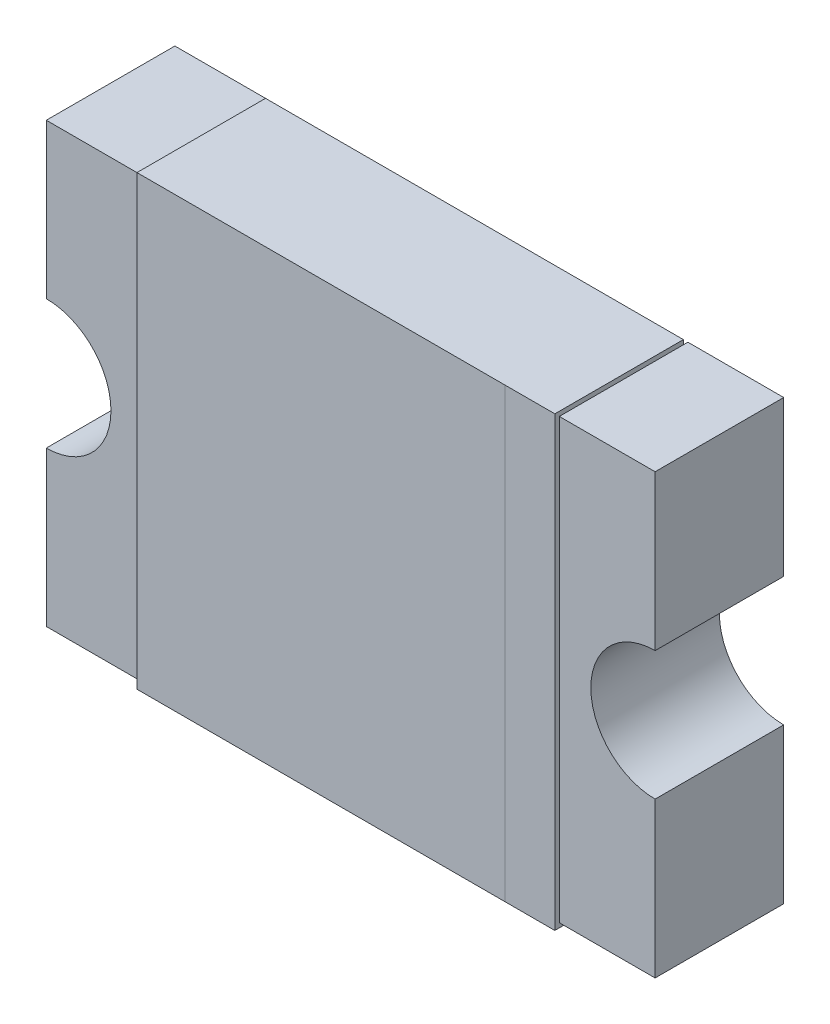
ISO-10303-21;
HEADER;
FILE_DESCRIPTION(('STEP AP214'),'2;1');
FILE_NAME('part.step','',(''),(''),'','','');
FILE_SCHEMA(('AUTOMOTIVE_DESIGN { 1 0 10303 214 1 1 1 1 }'));
ENDSEC;
DATA;
#1=APPLICATION_CONTEXT('core data for automotive mechanical design processes');
#2=APPLICATION_PROTOCOL_DEFINITION('international standard','automotive_design',2000,#1);
#3=PRODUCT_CONTEXT('',#1,'mechanical');
#4=PRODUCT('Part','Part','',(#3));
#5=PRODUCT_RELATED_PRODUCT_CATEGORY('part','',(#4));
#6=PRODUCT_DEFINITION_FORMATION('','',#4);
#7=PRODUCT_DEFINITION_CONTEXT('part definition',#1,'design');
#8=PRODUCT_DEFINITION('design','',#6,#7);
#9=PRODUCT_DEFINITION_SHAPE('','',#8);
#10=(LENGTH_UNIT() NAMED_UNIT(*) SI_UNIT(.MILLI.,.METRE.));
#11=(NAMED_UNIT(*) PLANE_ANGLE_UNIT() SI_UNIT($,.RADIAN.));
#12=(NAMED_UNIT(*) SI_UNIT($,.STERADIAN.) SOLID_ANGLE_UNIT());
#13=UNCERTAINTY_MEASURE_WITH_UNIT(LENGTH_MEASURE(1.E-05),#10,'distance_accuracy_value','');
#14=(GEOMETRIC_REPRESENTATION_CONTEXT(3) GLOBAL_UNCERTAINTY_ASSIGNED_CONTEXT((#13)) GLOBAL_UNIT_ASSIGNED_CONTEXT((#10,
#11,#12)) REPRESENTATION_CONTEXT('',''));
#15=CARTESIAN_POINT('',(0.,0.,0.));
#16=DIRECTION('',(0.,0.,1.));
#17=DIRECTION('',(1.,0.,0.));
#18=AXIS2_PLACEMENT_3D('',#15,#16,#17);
#19=CARTESIAN_POINT('',(-2.365,-1.705,0.));
#20=DIRECTION('',(0.,0.,1.));
#21=DIRECTION('',(1.,0.,0.));
#22=AXIS2_PLACEMENT_3D('',#19,#20,#21);
#23=PLANE('',#22);
#24=DIRECTION('',(-1.,0.,0.));
#25=VECTOR('',#24,1.);
#26=CARTESIAN_POINT('',(-2.365,1.705,0.));
#27=LINE('',#26,#25);
#28=CARTESIAN_POINT('',(-1.625,1.705,0.));
#29=VERTEX_POINT('',#28);
#30=CARTESIAN_POINT('',(-2.365,1.705,0.));
#31=VERTEX_POINT('',#30);
#32=EDGE_CURVE('E297',#29,#31,#27,.T.);
#33=ORIENTED_EDGE('',*,*,#32,.F.);
#34=DIRECTION('',(0.,1.,0.));
#35=VECTOR('',#34,1.);
#36=CARTESIAN_POINT('',(-1.625,-1.74,0.));
#37=LINE('',#36,#35);
#38=CARTESIAN_POINT('',(-1.625,-1.705,0.));
#39=VERTEX_POINT('',#38);
#40=EDGE_CURVE('E242',#39,#29,#37,.T.);
#41=ORIENTED_EDGE('',*,*,#40,.F.);
#42=DIRECTION('',(1.,0.,0.));
#43=VECTOR('',#42,1.);
#44=CARTESIAN_POINT('',(-2.365,-1.705,0.));
#45=LINE('',#44,#43);
#46=CARTESIAN_POINT('',(-2.365,-1.705,0.));
#47=VERTEX_POINT('',#46);
#48=EDGE_CURVE('E291',#47,#39,#45,.T.);
#49=ORIENTED_EDGE('',*,*,#48,.F.);
#50=DIRECTION('',(0.,-1.,0.));
#51=VECTOR('',#50,1.);
#52=CARTESIAN_POINT('',(-2.365,1.705,0.));
#53=LINE('',#52,#51);
#54=CARTESIAN_POINT('',(-2.365,-0.502851750543756,0.));
#55=VERTEX_POINT('',#54);
#56=EDGE_CURVE('E285',#55,#47,#53,.T.);
#57=ORIENTED_EDGE('',*,*,#56,.F.);
#58=CARTESIAN_POINT('',(-2.365,0.,0.));
#59=DIRECTION('',(0.,0.,1.));
#60=DIRECTION('',(1.,0.,0.));
#61=AXIS2_PLACEMENT_3D('',#58,#59,#60);
#62=CIRCLE('',#61,0.502851750543758);
#63=CARTESIAN_POINT('',(-2.365,0.502851750543758,0.));
#64=VERTEX_POINT('',#63);
#65=EDGE_CURVE('E336',#55,#64,#62,.T.);
#66=ORIENTED_EDGE('',*,*,#65,.T.);
#67=EDGE_CURVE('E282',#31,#64,#53,.T.);
#68=ORIENTED_EDGE('',*,*,#67,.F.);
#69=EDGE_LOOP('',(#33,#41,#49,#57,#66,#68));
#70=FACE_BOUND('',#69,.T.);
#71=ADVANCED_FACE('F34',(#70),#23,.F.);
#72=CARTESIAN_POINT('',(1.625,1.705,1.035));
#73=DIRECTION('',(-1.,0.,0.));
#74=DIRECTION('',(0.,-1.,0.));
#75=AXIS2_PLACEMENT_3D('',#72,#73,#74);
#76=PLANE('',#75);
#77=DIRECTION('',(0.,0.,-1.));
#78=VECTOR('',#77,1.);
#79=CARTESIAN_POINT('',(1.625,1.74,1.035));
#80=LINE('',#79,#78);
#81=CARTESIAN_POINT('',(1.625,1.74,1.0349));
#82=VERTEX_POINT('',#81);
#83=CARTESIAN_POINT('',(1.625,1.74,0.0349999999999999));
#84=VERTEX_POINT('',#83);
#85=EDGE_CURVE('E192',#82,#84,#80,.T.);
#86=ORIENTED_EDGE('',*,*,#85,.F.);
#87=DIRECTION('',(0.,1.,0.));
#88=VECTOR('',#87,1.);
#89=CARTESIAN_POINT('',(1.625,1.74,1.0349));
#90=LINE('',#89,#88);
#91=CARTESIAN_POINT('',(1.625,-1.74,1.0349));
#92=VERTEX_POINT('',#91);
#93=EDGE_CURVE('E175',#92,#82,#90,.T.);
#94=ORIENTED_EDGE('',*,*,#93,.F.);
#95=DIRECTION('',(0.,0.,1.));
#96=VECTOR('',#95,1.);
#97=CARTESIAN_POINT('',(1.625,-1.74,1.035));
#98=LINE('',#97,#96);
#99=CARTESIAN_POINT('',(1.625,-1.74,0.0350000000000001));
#100=VERTEX_POINT('',#99);
#101=EDGE_CURVE('E372',#100,#92,#98,.T.);
#102=ORIENTED_EDGE('',*,*,#101,.F.);
#103=DIRECTION('',(0.,-1.,0.));
#104=VECTOR('',#103,1.);
#105=CARTESIAN_POINT('',(1.625,-1.74,0.0350000000000001));
#106=LINE('',#105,#104);
#107=CARTESIAN_POINT('',(1.625,-1.705,0.0350000000000001));
#108=VERTEX_POINT('',#107);
#109=EDGE_CURVE('E60',#108,#100,#106,.T.);
#110=ORIENTED_EDGE('',*,*,#109,.F.);
#111=DIRECTION('',(0.,0.,1.));
#112=VECTOR('',#111,1.);
#113=CARTESIAN_POINT('',(1.625,-1.705,1.035));
#114=LINE('',#113,#112);
#115=CARTESIAN_POINT('',(1.625,-1.705,1.));
#116=VERTEX_POINT('',#115);
#117=EDGE_CURVE('E38',#108,#116,#114,.T.);
#118=ORIENTED_EDGE('',*,*,#117,.T.);
#119=DIRECTION('',(0.,1.,0.));
#120=VECTOR('',#119,1.);
#121=CARTESIAN_POINT('',(1.625,1.705,1.));
#122=LINE('',#121,#120);
#123=CARTESIAN_POINT('',(1.625,1.705,1.));
#124=VERTEX_POINT('',#123);
#125=EDGE_CURVE('E201',#116,#124,#122,.T.);
#126=ORIENTED_EDGE('',*,*,#125,.T.);
#127=DIRECTION('',(0.,0.,-1.));
#128=VECTOR('',#127,1.);
#129=CARTESIAN_POINT('',(1.625,1.705,1.035));
#130=LINE('',#129,#128);
#131=CARTESIAN_POINT('',(1.625,1.705,0.0349999999999999));
#132=VERTEX_POINT('',#131);
#133=EDGE_CURVE('E44',#124,#132,#130,.T.);
#134=ORIENTED_EDGE('',*,*,#133,.T.);
#135=EDGE_CURVE('E200',#84,#132,#106,.T.);
#136=ORIENTED_EDGE('',*,*,#135,.F.);
#137=EDGE_LOOP('',(#86,#94,#102,#110,#118,#126,#134,#136));
#138=FACE_BOUND('',#137,.T.);
#139=ADVANCED_FACE('F197',(#138),#76,.F.);
#140=CARTESIAN_POINT('',(-1.625,1.705,1.035));
#141=DIRECTION('',(1.,0.,0.));
#142=DIRECTION('',(0.,1.,0.));
#143=AXIS2_PLACEMENT_3D('',#140,#141,#142);
#144=PLANE('',#143);
#145=DIRECTION('',(0.,1.,0.));
#146=VECTOR('',#145,1.);
#147=CARTESIAN_POINT('',(-1.625,-1.74,0.0350000000000001));
#148=LINE('',#147,#146);
#149=CARTESIAN_POINT('',(-1.625,-1.74,0.0350000000000001));
#150=VERTEX_POINT('',#149);
#151=CARTESIAN_POINT('',(-1.625,-1.705,0.0350000000000001));
#152=VERTEX_POINT('',#151);
#153=EDGE_CURVE('E250',#150,#152,#148,.T.);
#154=ORIENTED_EDGE('',*,*,#153,.F.);
#155=DIRECTION('',(0.,0.,-1.));
#156=VECTOR('',#155,1.);
#157=CARTESIAN_POINT('',(-1.625,-1.74,1.035));
#158=LINE('',#157,#156);
#159=CARTESIAN_POINT('',(-1.625,-1.74,1.035));
#160=VERTEX_POINT('',#159);
#161=EDGE_CURVE('E232',#160,#150,#158,.T.);
#162=ORIENTED_EDGE('',*,*,#161,.F.);
#163=DIRECTION('',(0.,-1.,0.));
#164=VECTOR('',#163,1.);
#165=CARTESIAN_POINT('',(-1.625,1.705,1.035));
#166=LINE('',#165,#164);
#167=CARTESIAN_POINT('',(-1.625,1.74,1.035));
#168=VERTEX_POINT('',#167);
#169=EDGE_CURVE('E339',#168,#160,#166,.T.);
#170=ORIENTED_EDGE('',*,*,#169,.F.);
#171=DIRECTION('',(0.,0.,1.));
#172=VECTOR('',#171,1.);
#173=CARTESIAN_POINT('',(-1.625,1.74,1.035));
#174=LINE('',#173,#172);
#175=CARTESIAN_POINT('',(-1.625,1.74,0.0349999999999999));
#176=VERTEX_POINT('',#175);
#177=EDGE_CURVE('E207',#176,#168,#174,.T.);
#178=ORIENTED_EDGE('',*,*,#177,.F.);
#179=CARTESIAN_POINT('',(-1.625,1.705,0.0349999999999999));
#180=VERTEX_POINT('',#179);
#181=EDGE_CURVE('E248',#180,#176,#148,.T.);
#182=ORIENTED_EDGE('',*,*,#181,.F.);
#183=DIRECTION('',(0.,0.,1.));
#184=VECTOR('',#183,1.);
#185=CARTESIAN_POINT('',(-1.625,1.705,1.035));
#186=LINE('',#185,#184);
#187=CARTESIAN_POINT('',(-1.625,1.705,1.));
#188=VERTEX_POINT('',#187);
#189=EDGE_CURVE('E218',#180,#188,#186,.T.);
#190=ORIENTED_EDGE('',*,*,#189,.T.);
#191=DIRECTION('',(0.,-1.,0.));
#192=VECTOR('',#191,1.);
#193=CARTESIAN_POINT('',(-1.625,1.705,1.));
#194=LINE('',#193,#192);
#195=CARTESIAN_POINT('',(-1.625,-1.705,1.));
#196=VERTEX_POINT('',#195);
#197=EDGE_CURVE('E205',#188,#196,#194,.T.);
#198=ORIENTED_EDGE('',*,*,#197,.T.);
#199=DIRECTION('',(0.,0.,-1.));
#200=VECTOR('',#199,1.);
#201=CARTESIAN_POINT('',(-1.625,-1.705,1.035));
#202=LINE('',#201,#200);
#203=EDGE_CURVE('E11',#196,#152,#202,.T.);
#204=ORIENTED_EDGE('',*,*,#203,.T.);
#205=EDGE_LOOP('',(#154,#162,#170,#178,#182,#190,#198,#204));
#206=FACE_BOUND('',#205,.T.);
#207=ADVANCED_FACE('F254',(#206),#144,.F.);
#208=CARTESIAN_POINT('',(-1.625,1.74,0.));
#209=DIRECTION('',(0.,-1.,0.));
#210=DIRECTION('',(0.,0.,-1.));
#211=AXIS2_PLACEMENT_3D('',#208,#209,#210);
#212=PLANE('',#211);
#213=DIRECTION('',(1.,0.,0.));
#214=VECTOR('',#213,1.);
#215=CARTESIAN_POINT('',(-1.625,1.74,1.035));
#216=LINE('',#215,#214);
#217=CARTESIAN_POINT('',(1.23686777791931,1.74,1.035));
#218=VERTEX_POINT('',#217);
#219=EDGE_CURVE('E202',#168,#218,#216,.T.);
#220=ORIENTED_EDGE('',*,*,#219,.T.);
#221=DIRECTION('',(0.,0.,1.));
#222=VECTOR('',#221,1.);
#223=CARTESIAN_POINT('',(1.23686777791931,1.74,1.0349));
#224=LINE('',#223,#222);
#225=CARTESIAN_POINT('',(1.23686777791931,1.74,1.0349));
#226=VERTEX_POINT('',#225);
#227=EDGE_CURVE('E52',#226,#218,#224,.T.);
#228=ORIENTED_EDGE('',*,*,#227,.F.);
#229=DIRECTION('',(-1.,0.,0.));
#230=VECTOR('',#229,1.);
#231=CARTESIAN_POINT('',(1.625,1.74,1.0349));
#232=LINE('',#231,#230);
#233=EDGE_CURVE('E179',#82,#226,#232,.T.);
#234=ORIENTED_EDGE('',*,*,#233,.F.);
#235=ORIENTED_EDGE('',*,*,#85,.T.);
#236=DIRECTION('',(1.,0.,0.));
#237=VECTOR('',#236,1.);
#238=CARTESIAN_POINT('',(-1.625,1.74,0.0349999999999999));
#239=LINE('',#238,#237);
#240=EDGE_CURVE('E384',#176,#84,#239,.T.);
#241=ORIENTED_EDGE('',*,*,#240,.F.);
#242=ORIENTED_EDGE('',*,*,#177,.T.);
#243=EDGE_LOOP('',(#220,#228,#234,#235,#241,#242));
#244=FACE_BOUND('',#243,.T.);
#245=ADVANCED_FACE('F190',(#244),#212,.F.);
#246=CARTESIAN_POINT('',(-1.625,-1.74,0.));
#247=DIRECTION('',(0.,-1.,0.));
#248=DIRECTION('',(0.,0.,-1.));
#249=AXIS2_PLACEMENT_3D('',#246,#247,#248);
#250=PLANE('',#249);
#251=DIRECTION('',(0.,0.,1.));
#252=VECTOR('',#251,1.);
#253=CARTESIAN_POINT('',(1.23686777791931,-1.74,1.0349));
#254=LINE('',#253,#252);
#255=CARTESIAN_POINT('',(1.23686777791931,-1.74,1.0349));
#256=VERTEX_POINT('',#255);
#257=CARTESIAN_POINT('',(1.23686777791931,-1.74,1.035));
#258=VERTEX_POINT('',#257);
#259=EDGE_CURVE('E376',#256,#258,#254,.T.);
#260=ORIENTED_EDGE('',*,*,#259,.T.);
#261=DIRECTION('',(-1.,0.,0.));
#262=VECTOR('',#261,1.);
#263=CARTESIAN_POINT('',(-1.625,-1.74,1.035));
#264=LINE('',#263,#262);
#265=EDGE_CURVE('E219',#258,#160,#264,.T.);
#266=ORIENTED_EDGE('',*,*,#265,.T.);
#267=ORIENTED_EDGE('',*,*,#161,.T.);
#268=DIRECTION('',(-1.,0.,0.));
#269=VECTOR('',#268,1.);
#270=CARTESIAN_POINT('',(-1.625,-1.74,0.0350000000000001));
#271=LINE('',#270,#269);
#272=EDGE_CURVE('E364',#100,#150,#271,.T.);
#273=ORIENTED_EDGE('',*,*,#272,.F.);
#274=ORIENTED_EDGE('',*,*,#101,.T.);
#275=DIRECTION('',(1.,0.,0.));
#276=VECTOR('',#275,1.);
#277=CARTESIAN_POINT('',(1.625,-1.74,1.0349));
#278=LINE('',#277,#276);
#279=EDGE_CURVE('E181',#256,#92,#278,.T.);
#280=ORIENTED_EDGE('',*,*,#279,.F.);
#281=EDGE_LOOP('',(#260,#266,#267,#273,#274,#280));
#282=FACE_BOUND('',#281,.T.);
#283=ADVANCED_FACE('F375',(#282),#250,.T.);
#284=CARTESIAN_POINT('',(-2.365,-1.705,1.));
#285=DIRECTION('',(0.,1.,0.));
#286=DIRECTION('',(0.,0.,1.));
#287=AXIS2_PLACEMENT_3D('',#284,#285,#286);
#288=PLANE('',#287);
#289=ORIENTED_EDGE('',*,*,#203,.F.);
#290=DIRECTION('',(1.,0.,0.));
#291=VECTOR('',#290,1.);
#292=CARTESIAN_POINT('',(-2.365,-1.705,1.));
#293=LINE('',#292,#291);
#294=CARTESIAN_POINT('',(-2.365,-1.705,1.));
#295=VERTEX_POINT('',#294);
#296=EDGE_CURVE('E320',#295,#196,#293,.T.);
#297=ORIENTED_EDGE('',*,*,#296,.F.);
#298=DIRECTION('',(0.,0.,-1.));
#299=VECTOR('',#298,1.);
#300=CARTESIAN_POINT('',(-2.365,-1.705,1.));
#301=LINE('',#300,#299);
#302=EDGE_CURVE('E310',#295,#47,#301,.T.);
#303=ORIENTED_EDGE('',*,*,#302,.T.);
#304=ORIENTED_EDGE('',*,*,#48,.T.);
#305=DIRECTION('',(0.,0.,1.));
#306=VECTOR('',#305,1.);
#307=CARTESIAN_POINT('',(-1.625,-1.705,1.));
#308=LINE('',#307,#306);
#309=EDGE_CURVE('E360',#39,#152,#308,.T.);
#310=ORIENTED_EDGE('',*,*,#309,.T.);
#311=EDGE_LOOP('',(#289,#297,#303,#304,#310));
#312=FACE_BOUND('',#311,.T.);
#313=ADVANCED_FACE('F355',(#312),#288,.F.);
#314=CARTESIAN_POINT('',(1.625,-1.705,0.));
#315=VERTEX_POINT('',#314);
#316=EDGE_CURVE('E230',#315,#108,#114,.T.);
#317=ORIENTED_EDGE('',*,*,#316,.F.);
#318=CARTESIAN_POINT('',(2.37,-1.705,0.));
#319=VERTEX_POINT('',#318);
#320=EDGE_CURVE('E222',#315,#319,#45,.T.);
#321=ORIENTED_EDGE('',*,*,#320,.T.);
#322=DIRECTION('',(0.,0.,-1.));
#323=VECTOR('',#322,1.);
#324=CARTESIAN_POINT('',(2.37,-1.705,1.));
#325=LINE('',#324,#323);
#326=CARTESIAN_POINT('',(2.37,-1.705,1.));
#327=VERTEX_POINT('',#326);
#328=EDGE_CURVE('E307',#327,#319,#325,.T.);
#329=ORIENTED_EDGE('',*,*,#328,.F.);
#330=EDGE_CURVE('E322',#116,#327,#293,.T.);
#331=ORIENTED_EDGE('',*,*,#330,.F.);
#332=ORIENTED_EDGE('',*,*,#117,.F.);
#333=EDGE_LOOP('',(#317,#321,#329,#331,#332));
#334=FACE_BOUND('',#333,.T.);
#335=ADVANCED_FACE('F404',(#334),#288,.F.);
#336=CARTESIAN_POINT('',(-2.365,1.705,1.));
#337=DIRECTION('',(0.,-1.,0.));
#338=DIRECTION('',(0.,0.,-1.));
#339=AXIS2_PLACEMENT_3D('',#336,#337,#338);
#340=PLANE('',#339);
#341=EDGE_CURVE('E216',#29,#180,#186,.T.);
#342=ORIENTED_EDGE('',*,*,#341,.F.);
#343=ORIENTED_EDGE('',*,*,#32,.T.);
#344=DIRECTION('',(0.,0.,-1.));
#345=VECTOR('',#344,1.);
#346=CARTESIAN_POINT('',(-2.365,1.705,1.));
#347=LINE('',#346,#345);
#348=CARTESIAN_POINT('',(-2.365,1.705,1.));
#349=VERTEX_POINT('',#348);
#350=EDGE_CURVE('E263',#349,#31,#347,.T.);
#351=ORIENTED_EDGE('',*,*,#350,.F.);
#352=DIRECTION('',(-1.,0.,0.));
#353=VECTOR('',#352,1.);
#354=CARTESIAN_POINT('',(-2.365,1.705,1.));
#355=LINE('',#354,#353);
#356=EDGE_CURVE('E261',#188,#349,#355,.T.);
#357=ORIENTED_EDGE('',*,*,#356,.F.);
#358=ORIENTED_EDGE('',*,*,#189,.F.);
#359=EDGE_LOOP('',(#342,#343,#351,#357,#358));
#360=FACE_BOUND('',#359,.T.);
#361=ADVANCED_FACE('F259',(#360),#340,.F.);
#362=ORIENTED_EDGE('',*,*,#133,.F.);
#363=CARTESIAN_POINT('',(2.37,1.705,1.));
#364=VERTEX_POINT('',#363);
#365=EDGE_CURVE('E267',#364,#124,#355,.T.);
#366=ORIENTED_EDGE('',*,*,#365,.F.);
#367=DIRECTION('',(0.,0.,-1.));
#368=VECTOR('',#367,1.);
#369=CARTESIAN_POINT('',(2.37,1.705,1.));
#370=LINE('',#369,#368);
#371=CARTESIAN_POINT('',(2.37,1.705,0.));
#372=VERTEX_POINT('',#371);
#373=EDGE_CURVE('E304',#364,#372,#370,.T.);
#374=ORIENTED_EDGE('',*,*,#373,.T.);
#375=CARTESIAN_POINT('',(1.625,1.705,0.));
#376=VERTEX_POINT('',#375);
#377=EDGE_CURVE('E299',#372,#376,#27,.T.);
#378=ORIENTED_EDGE('',*,*,#377,.T.);
#379=DIRECTION('',(0.,0.,1.));
#380=VECTOR('',#379,1.);
#381=CARTESIAN_POINT('',(1.625,1.705,1.));
#382=LINE('',#381,#380);
#383=EDGE_CURVE('E361',#376,#132,#382,.T.);
#384=ORIENTED_EDGE('',*,*,#383,.T.);
#385=EDGE_LOOP('',(#362,#366,#374,#378,#384));
#386=FACE_BOUND('',#385,.T.);
#387=ADVANCED_FACE('F421',(#386),#340,.F.);
#388=CARTESIAN_POINT('',(-2.365,-1.705,1.));
#389=DIRECTION('',(0.,0.,1.));
#390=DIRECTION('',(1.,0.,0.));
#391=AXIS2_PLACEMENT_3D('',#388,#389,#390);
#392=PLANE('',#391);
#393=ORIENTED_EDGE('',*,*,#125,.F.);
#394=ORIENTED_EDGE('',*,*,#330,.T.);
#395=DIRECTION('',(0.,1.,0.));
#396=VECTOR('',#395,1.);
#397=CARTESIAN_POINT('',(2.37,1.705,1.));
#398=LINE('',#397,#396);
#399=CARTESIAN_POINT('',(2.37,-0.500000000000001,1.));
#400=VERTEX_POINT('',#399);
#401=EDGE_CURVE('E268',#327,#400,#398,.T.);
#402=ORIENTED_EDGE('',*,*,#401,.T.);
#403=CARTESIAN_POINT('',(2.37,0.,1.));
#404=DIRECTION('',(0.,0.,-1.));
#405=DIRECTION('',(0.,1.,0.));
#406=AXIS2_PLACEMENT_3D('',#403,#404,#405);
#407=CIRCLE('',#406,0.5);
#408=CARTESIAN_POINT('',(2.37,0.499999999999999,1.));
#409=VERTEX_POINT('',#408);
#410=EDGE_CURVE('E333',#400,#409,#407,.T.);
#411=ORIENTED_EDGE('',*,*,#410,.T.);
#412=EDGE_CURVE('E273',#409,#364,#398,.T.);
#413=ORIENTED_EDGE('',*,*,#412,.T.);
#414=ORIENTED_EDGE('',*,*,#365,.T.);
#415=EDGE_LOOP('',(#393,#394,#402,#411,#413,#414));
#416=FACE_BOUND('',#415,.T.);
#417=ADVANCED_FACE('F424',(#416),#392,.T.);
#418=CARTESIAN_POINT('',(-2.365,1.705,1.));
#419=DIRECTION('',(1.,0.,0.));
#420=DIRECTION('',(0.,1.,0.));
#421=AXIS2_PLACEMENT_3D('',#418,#419,#420);
#422=PLANE('',#421);
#423=ORIENTED_EDGE('',*,*,#67,.T.);
#424=DIRECTION('',(0.,0.,1.));
#425=VECTOR('',#424,1.);
#426=CARTESIAN_POINT('',(-2.365,0.502851750543758,0.));
#427=LINE('',#426,#425);
#428=CARTESIAN_POINT('',(-2.365,0.502851750543758,1.));
#429=VERTEX_POINT('',#428);
#430=EDGE_CURVE('E296',#64,#429,#427,.T.);
#431=ORIENTED_EDGE('',*,*,#430,.T.);
#432=DIRECTION('',(0.,-1.,0.));
#433=VECTOR('',#432,1.);
#434=CARTESIAN_POINT('',(-2.365,1.705,1.));
#435=LINE('',#434,#433);
#436=EDGE_CURVE('E325',#349,#429,#435,.T.);
#437=ORIENTED_EDGE('',*,*,#436,.F.);
#438=ORIENTED_EDGE('',*,*,#350,.T.);
#439=EDGE_LOOP('',(#423,#431,#437,#438));
#440=FACE_BOUND('',#439,.T.);
#441=ADVANCED_FACE('F430',(#440),#422,.F.);
#442=CARTESIAN_POINT('',(2.37,1.705,1.));
#443=DIRECTION('',(-1.,0.,0.));
#444=DIRECTION('',(0.,-1.,0.));
#445=AXIS2_PLACEMENT_3D('',#442,#443,#444);
#446=PLANE('',#445);
#447=DIRECTION('',(0.,0.,1.));
#448=VECTOR('',#447,1.);
#449=CARTESIAN_POINT('',(2.37,-0.500000000000001,0.));
#450=LINE('',#449,#448);
#451=CARTESIAN_POINT('',(2.37,-0.500000000000001,0.));
#452=VERTEX_POINT('',#451);
#453=EDGE_CURVE('E329',#400,#452,#450,.F.);
#454=ORIENTED_EDGE('',*,*,#453,.F.);
#455=ORIENTED_EDGE('',*,*,#401,.F.);
#456=ORIENTED_EDGE('',*,*,#328,.T.);
#457=DIRECTION('',(0.,1.,0.));
#458=VECTOR('',#457,1.);
#459=CARTESIAN_POINT('',(2.37,1.705,0.));
#460=LINE('',#459,#458);
#461=EDGE_CURVE('E288',#319,#452,#460,.T.);
#462=ORIENTED_EDGE('',*,*,#461,.T.);
#463=EDGE_LOOP('',(#454,#455,#456,#462));
#464=FACE_BOUND('',#463,.T.);
#465=ADVANCED_FACE('F428',(#464),#446,.F.);
#466=DIRECTION('',(0.,0.,1.));
#467=VECTOR('',#466,1.);
#468=CARTESIAN_POINT('',(2.37,0.499999999999999,0.));
#469=LINE('',#468,#467);
#470=CARTESIAN_POINT('',(2.37,0.499999999999999,0.));
#471=VERTEX_POINT('',#470);
#472=EDGE_CURVE('E331',#471,#409,#469,.T.);
#473=ORIENTED_EDGE('',*,*,#472,.F.);
#474=EDGE_CURVE('E294',#471,#372,#460,.T.);
#475=ORIENTED_EDGE('',*,*,#474,.T.);
#476=ORIENTED_EDGE('',*,*,#373,.F.);
#477=ORIENTED_EDGE('',*,*,#412,.F.);
#478=EDGE_LOOP('',(#473,#475,#476,#477));
#479=FACE_BOUND('',#478,.T.);
#480=ADVANCED_FACE('F417',(#479),#446,.F.);
#481=ORIENTED_EDGE('',*,*,#197,.F.);
#482=ORIENTED_EDGE('',*,*,#356,.T.);
#483=ORIENTED_EDGE('',*,*,#436,.T.);
#484=CARTESIAN_POINT('',(-2.365,0.,1.));
#485=DIRECTION('',(0.,0.,1.));
#486=DIRECTION('',(1.,0.,0.));
#487=AXIS2_PLACEMENT_3D('',#484,#485,#486);
#488=CIRCLE('',#487,0.502851750543758);
#489=CARTESIAN_POINT('',(-2.365,-0.502851750543757,1.));
#490=VERTEX_POINT('',#489);
#491=EDGE_CURVE('E337',#490,#429,#488,.T.);
#492=ORIENTED_EDGE('',*,*,#491,.F.);
#493=EDGE_CURVE('E328',#490,#295,#435,.T.);
#494=ORIENTED_EDGE('',*,*,#493,.T.);
#495=ORIENTED_EDGE('',*,*,#296,.T.);
#496=EDGE_LOOP('',(#481,#482,#483,#492,#494,#495));
#497=FACE_BOUND('',#496,.T.);
#498=ADVANCED_FACE('F349',(#497),#392,.T.);
#499=ORIENTED_EDGE('',*,*,#320,.F.);
#500=DIRECTION('',(0.,-1.,0.));
#501=VECTOR('',#500,1.);
#502=CARTESIAN_POINT('',(1.625,-1.74,0.));
#503=LINE('',#502,#501);
#504=EDGE_CURVE('E257',#376,#315,#503,.T.);
#505=ORIENTED_EDGE('',*,*,#504,.F.);
#506=ORIENTED_EDGE('',*,*,#377,.F.);
#507=ORIENTED_EDGE('',*,*,#474,.F.);
#508=CARTESIAN_POINT('',(2.37,0.,0.));
#509=DIRECTION('',(0.,0.,1.));
#510=DIRECTION('',(1.,0.,0.));
#511=AXIS2_PLACEMENT_3D('',#508,#509,#510);
#512=CIRCLE('',#511,0.5);
#513=EDGE_CURVE('E313',#452,#471,#512,.F.);
#514=ORIENTED_EDGE('',*,*,#513,.F.);
#515=ORIENTED_EDGE('',*,*,#461,.F.);
#516=EDGE_LOOP('',(#499,#505,#506,#507,#514,#515));
#517=FACE_BOUND('',#516,.T.);
#518=ADVANCED_FACE('F408',(#517),#23,.F.);
#519=ORIENTED_EDGE('',*,*,#493,.F.);
#520=DIRECTION('',(0.,0.,1.));
#521=VECTOR('',#520,1.);
#522=CARTESIAN_POINT('',(-2.365,-0.502851750543757,0.));
#523=LINE('',#522,#521);
#524=EDGE_CURVE('E315',#490,#55,#523,.F.);
#525=ORIENTED_EDGE('',*,*,#524,.T.);
#526=ORIENTED_EDGE('',*,*,#56,.T.);
#527=ORIENTED_EDGE('',*,*,#302,.F.);
#528=EDGE_LOOP('',(#519,#525,#526,#527));
#529=FACE_BOUND('',#528,.T.);
#530=ADVANCED_FACE('F36',(#529),#422,.F.);
#531=CARTESIAN_POINT('',(2.37,0.,0.));
#532=DIRECTION('',(0.,0.,1.));
#533=DIRECTION('',(0.,-1.,0.));
#534=AXIS2_PLACEMENT_3D('',#531,#532,#533);
#535=CYLINDRICAL_SURFACE('',#534,0.5);
#536=ORIENTED_EDGE('',*,*,#453,.T.);
#537=ORIENTED_EDGE('',*,*,#513,.T.);
#538=ORIENTED_EDGE('',*,*,#472,.T.);
#539=ORIENTED_EDGE('',*,*,#410,.F.);
#540=EDGE_LOOP('',(#536,#537,#538,#539));
#541=FACE_BOUND('',#540,.T.);
#542=ADVANCED_FACE('F427',(#541),#535,.F.);
#543=CARTESIAN_POINT('',(-2.365,0.,0.));
#544=DIRECTION('',(0.,0.,1.));
#545=DIRECTION('',(1.,0.,0.));
#546=AXIS2_PLACEMENT_3D('',#543,#544,#545);
#547=CYLINDRICAL_SURFACE('',#546,0.502851750543758);
#548=ORIENTED_EDGE('',*,*,#65,.F.);
#549=ORIENTED_EDGE('',*,*,#524,.F.);
#550=ORIENTED_EDGE('',*,*,#491,.T.);
#551=ORIENTED_EDGE('',*,*,#430,.F.);
#552=EDGE_LOOP('',(#548,#549,#550,#551));
#553=FACE_BOUND('',#552,.T.);
#554=ADVANCED_FACE('F479',(#553),#547,.F.);
#555=CARTESIAN_POINT('',(1.625,1.705,1.035));
#556=DIRECTION('',(0.,0.,-1.));
#557=DIRECTION('',(-1.,0.,0.));
#558=AXIS2_PLACEMENT_3D('',#555,#556,#557);
#559=PLANE('',#558);
#560=ORIENTED_EDGE('',*,*,#265,.F.);
#561=DIRECTION('',(0.,-1.,0.));
#562=VECTOR('',#561,1.);
#563=CARTESIAN_POINT('',(1.23686777791931,1.74,1.035));
#564=LINE('',#563,#562);
#565=EDGE_CURVE('E186',#218,#258,#564,.T.);
#566=ORIENTED_EDGE('',*,*,#565,.F.);
#567=ORIENTED_EDGE('',*,*,#219,.F.);
#568=ORIENTED_EDGE('',*,*,#169,.T.);
#569=EDGE_LOOP('',(#560,#566,#567,#568));
#570=FACE_BOUND('',#569,.T.);
#571=ADVANCED_FACE('F377',(#570),#559,.F.);
#572=CARTESIAN_POINT('',(-1.625,-1.74,0.0350000000000001));
#573=DIRECTION('',(-1.,0.,0.));
#574=DIRECTION('',(0.,0.,1.));
#575=AXIS2_PLACEMENT_3D('',#572,#573,#574);
#576=PLANE('',#575);
#577=ORIENTED_EDGE('',*,*,#40,.T.);
#578=ORIENTED_EDGE('',*,*,#341,.T.);
#579=EDGE_CURVE('E239',#152,#180,#148,.T.);
#580=ORIENTED_EDGE('',*,*,#579,.F.);
#581=ORIENTED_EDGE('',*,*,#309,.F.);
#582=EDGE_LOOP('',(#577,#578,#580,#581));
#583=FACE_BOUND('',#582,.T.);
#584=ADVANCED_FACE('F238',(#583),#576,.F.);
#585=CARTESIAN_POINT('',(1.625,-1.74,0.0350000000000001));
#586=DIRECTION('',(1.,0.,0.));
#587=DIRECTION('',(0.,0.,-1.));
#588=AXIS2_PLACEMENT_3D('',#585,#586,#587);
#589=PLANE('',#588);
#590=EDGE_CURVE('E387',#132,#108,#106,.T.);
#591=ORIENTED_EDGE('',*,*,#590,.F.);
#592=ORIENTED_EDGE('',*,*,#383,.F.);
#593=ORIENTED_EDGE('',*,*,#504,.T.);
#594=ORIENTED_EDGE('',*,*,#316,.T.);
#595=EDGE_LOOP('',(#591,#592,#593,#594));
#596=FACE_BOUND('',#595,.T.);
#597=ADVANCED_FACE('F397',(#596),#589,.F.);
#598=CARTESIAN_POINT('',(-1.625,1.74,0.0349999999999999));
#599=DIRECTION('',(0.,0.,-1.));
#600=DIRECTION('',(0.,1.,0.));
#601=AXIS2_PLACEMENT_3D('',#598,#599,#600);
#602=PLANE('',#601);
#603=ORIENTED_EDGE('',*,*,#153,.T.);
#604=ORIENTED_EDGE('',*,*,#579,.T.);
#605=ORIENTED_EDGE('',*,*,#181,.T.);
#606=ORIENTED_EDGE('',*,*,#240,.T.);
#607=ORIENTED_EDGE('',*,*,#135,.T.);
#608=ORIENTED_EDGE('',*,*,#590,.T.);
#609=ORIENTED_EDGE('',*,*,#109,.T.);
#610=ORIENTED_EDGE('',*,*,#272,.T.);
#611=EDGE_LOOP('',(#603,#604,#605,#606,#607,#608,#609,#610));
#612=FACE_BOUND('',#611,.T.);
#613=ADVANCED_FACE('F247',(#612),#602,.T.);
#614=CARTESIAN_POINT('',(1.23686777791931,1.74,1.0349));
#615=DIRECTION('',(-1.,0.,0.));
#616=DIRECTION('',(0.,0.,1.));
#617=AXIS2_PLACEMENT_3D('',#614,#615,#616);
#618=PLANE('',#617);
#619=ORIENTED_EDGE('',*,*,#565,.T.);
#620=ORIENTED_EDGE('',*,*,#259,.F.);
#621=DIRECTION('',(0.,-1.,0.));
#622=VECTOR('',#621,1.);
#623=CARTESIAN_POINT('',(1.23686777791931,1.74,1.0349));
#624=LINE('',#623,#622);
#625=EDGE_CURVE('E194',#226,#256,#624,.T.);
#626=ORIENTED_EDGE('',*,*,#625,.F.);
#627=ORIENTED_EDGE('',*,*,#227,.T.);
#628=EDGE_LOOP('',(#619,#620,#626,#627));
#629=FACE_BOUND('',#628,.T.);
#630=ADVANCED_FACE('F516',(#629),#618,.F.);
#631=CARTESIAN_POINT('',(1.625,-1.74,1.0349));
#632=DIRECTION('',(0.,0.,-1.));
#633=DIRECTION('',(-1.,0.,0.));
#634=AXIS2_PLACEMENT_3D('',#631,#632,#633);
#635=PLANE('',#634);
#636=ORIENTED_EDGE('',*,*,#93,.T.);
#637=ORIENTED_EDGE('',*,*,#233,.T.);
#638=ORIENTED_EDGE('',*,*,#625,.T.);
#639=ORIENTED_EDGE('',*,*,#279,.T.);
#640=EDGE_LOOP('',(#636,#637,#638,#639));
#641=FACE_BOUND('',#640,.T.);
#642=ADVANCED_FACE('F177',(#641),#635,.F.);
#643=CLOSED_SHELL('',(#71,#139,#207,#245,#283,#313,#335,#361,#387,#417,#441,#465,#480,#498,#518,
#530,#542,#554,#571,#584,#597,#613,#630,#642));
#644=MANIFOLD_SOLID_BREP('B2',#643);
#645=ADVANCED_BREP_SHAPE_REPRESENTATION('',(#18,#644),#14);
#646=SHAPE_DEFINITION_REPRESENTATION(#9,#645);
ENDSEC;
END-ISO-10303-21;
